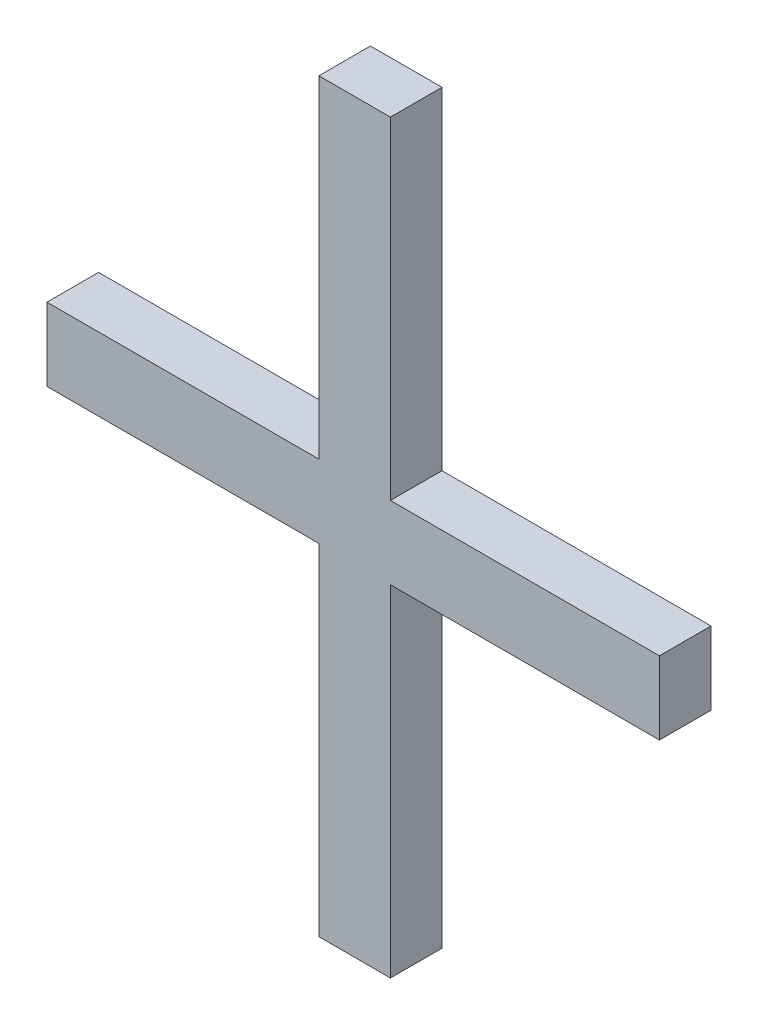
ISO-10303-21;
HEADER;
FILE_DESCRIPTION(('STEP AP214'),'2;1');
FILE_NAME('part.step','',(''),(''),'','','');
FILE_SCHEMA(('AUTOMOTIVE_DESIGN { 1 0 10303 214 1 1 1 1 }'));
ENDSEC;
DATA;
#1=APPLICATION_CONTEXT('core data for automotive mechanical design processes');
#2=APPLICATION_PROTOCOL_DEFINITION('international standard','automotive_design',2000,#1);
#3=PRODUCT_CONTEXT('',#1,'mechanical');
#4=PRODUCT('Part','Part','',(#3));
#5=PRODUCT_RELATED_PRODUCT_CATEGORY('part','',(#4));
#6=PRODUCT_DEFINITION_FORMATION('','',#4);
#7=PRODUCT_DEFINITION_CONTEXT('part definition',#1,'design');
#8=PRODUCT_DEFINITION('design','',#6,#7);
#9=PRODUCT_DEFINITION_SHAPE('','',#8);
#10=(LENGTH_UNIT() NAMED_UNIT(*) SI_UNIT(.MILLI.,.METRE.));
#11=(NAMED_UNIT(*) PLANE_ANGLE_UNIT() SI_UNIT($,.RADIAN.));
#12=(NAMED_UNIT(*) SI_UNIT($,.STERADIAN.) SOLID_ANGLE_UNIT());
#13=UNCERTAINTY_MEASURE_WITH_UNIT(LENGTH_MEASURE(1.E-05),#10,'distance_accuracy_value','');
#14=(GEOMETRIC_REPRESENTATION_CONTEXT(3) GLOBAL_UNCERTAINTY_ASSIGNED_CONTEXT((#13)) GLOBAL_UNIT_ASSIGNED_CONTEXT((#10,
#11,#12)) REPRESENTATION_CONTEXT('',''));
#15=CARTESIAN_POINT('',(0.,0.,0.));
#16=DIRECTION('',(0.,0.,1.));
#17=DIRECTION('',(1.,0.,0.));
#18=AXIS2_PLACEMENT_3D('',#15,#16,#17);
#19=CARTESIAN_POINT('',(149.53068351896,58.9393713969111,-39.));
#20=DIRECTION('',(0.,0.,1.));
#21=DIRECTION('',(1.,0.,0.));
#22=AXIS2_PLACEMENT_3D('',#19,#20,#21);
#23=PLANE('',#22);
#24=DIRECTION('',(0.,1.,0.));
#25=VECTOR('',#24,1.);
#26=CARTESIAN_POINT('',(150.05772928872,59.7243922013511,-39.));
#27=LINE('',#26,#25);
#28=CARTESIAN_POINT('',(150.05772928872,59.7243922013511,-39.));
#29=VERTEX_POINT('',#28);
#30=CARTESIAN_POINT('',(150.05772928872,59.0808415772111,-39.));
#31=VERTEX_POINT('',#30);
#32=EDGE_CURVE('E159',#29,#31,#27,.F.);
#33=ORIENTED_EDGE('',*,*,#32,.T.);
#34=DIRECTION('',(1.,0.,0.));
#35=VECTOR('',#34,1.);
#36=CARTESIAN_POINT('',(150.05772928872,59.0808415772111,-39.));
#37=LINE('',#36,#35);
#38=CARTESIAN_POINT('',(149.53068351896,59.0808415772111,-39.));
#39=VERTEX_POINT('',#38);
#40=EDGE_CURVE('E164',#31,#39,#37,.F.);
#41=ORIENTED_EDGE('',*,*,#40,.T.);
#42=DIRECTION('',(0.,1.,0.));
#43=VECTOR('',#42,1.);
#44=CARTESIAN_POINT('',(149.53068351896,59.0808415772111,-39.));
#45=LINE('',#44,#43);
#46=CARTESIAN_POINT('',(149.53068351896,58.9393713969111,-39.));
#47=VERTEX_POINT('',#46);
#48=EDGE_CURVE('E106',#39,#47,#45,.F.);
#49=ORIENTED_EDGE('',*,*,#48,.T.);
#50=DIRECTION('',(1.,0.,0.));
#51=VECTOR('',#50,1.);
#52=CARTESIAN_POINT('',(149.53068351896,58.9393713969111,-39.));
#53=LINE('',#52,#51);
#54=CARTESIAN_POINT('',(150.05772928872,58.9393713969111,-39.));
#55=VERTEX_POINT('',#54);
#56=EDGE_CURVE('E20',#47,#55,#53,.T.);
#57=ORIENTED_EDGE('',*,*,#56,.T.);
#58=DIRECTION('',(0.,1.,0.));
#59=VECTOR('',#58,1.);
#60=CARTESIAN_POINT('',(150.05772928872,58.9393713969111,-39.));
#61=LINE('',#60,#59);
#62=CARTESIAN_POINT('',(150.05772928872,58.2791772221511,-39.));
#63=VERTEX_POINT('',#62);
#64=EDGE_CURVE('E103',#55,#63,#61,.F.);
#65=ORIENTED_EDGE('',*,*,#64,.T.);
#66=DIRECTION('',(1.,0.,0.));
#67=VECTOR('',#66,1.);
#68=CARTESIAN_POINT('',(150.05772928872,58.2791772221511,-39.));
#69=LINE('',#68,#67);
#70=CARTESIAN_POINT('',(150.19642554392,58.2791772221511,-39.));
#71=VERTEX_POINT('',#70);
#72=EDGE_CURVE('E124',#63,#71,#69,.T.);
#73=ORIENTED_EDGE('',*,*,#72,.T.);
#74=DIRECTION('',(0.,1.,0.));
#75=VECTOR('',#74,1.);
#76=CARTESIAN_POINT('',(150.19642554392,58.2791772221511,-39.));
#77=LINE('',#76,#75);
#78=CARTESIAN_POINT('',(150.19642554392,58.9393713969111,-39.));
#79=VERTEX_POINT('',#78);
#80=EDGE_CURVE('E129',#71,#79,#77,.T.);
#81=ORIENTED_EDGE('',*,*,#80,.T.);
#82=DIRECTION('',(1.,0.,0.));
#83=VECTOR('',#82,1.);
#84=CARTESIAN_POINT('',(150.19642554392,58.9393713969111,-39.));
#85=LINE('',#84,#83);
#86=CARTESIAN_POINT('',(150.71792346348,58.9393713969111,-39.));
#87=VERTEX_POINT('',#86);
#88=EDGE_CURVE('E134',#79,#87,#85,.T.);
#89=ORIENTED_EDGE('',*,*,#88,.T.);
#90=DIRECTION('',(0.,1.,0.));
#91=VECTOR('',#90,1.);
#92=CARTESIAN_POINT('',(150.71792346348,58.9393713969111,-39.));
#93=LINE('',#92,#91);
#94=CARTESIAN_POINT('',(150.71792346348,59.0808415772111,-39.));
#95=VERTEX_POINT('',#94);
#96=EDGE_CURVE('E139',#87,#95,#93,.T.);
#97=ORIENTED_EDGE('',*,*,#96,.T.);
#98=DIRECTION('',(1.,0.,0.));
#99=VECTOR('',#98,1.);
#100=CARTESIAN_POINT('',(150.71792346348,59.0808415772111,-39.));
#101=LINE('',#100,#99);
#102=CARTESIAN_POINT('',(150.19642554392,59.0808415772111,-39.));
#103=VERTEX_POINT('',#102);
#104=EDGE_CURVE('E144',#95,#103,#101,.F.);
#105=ORIENTED_EDGE('',*,*,#104,.T.);
#106=DIRECTION('',(0.,1.,0.));
#107=VECTOR('',#106,1.);
#108=CARTESIAN_POINT('',(150.19642554392,59.0808415772111,-39.));
#109=LINE('',#108,#107);
#110=CARTESIAN_POINT('',(150.19642554392,59.7243922013511,-39.));
#111=VERTEX_POINT('',#110);
#112=EDGE_CURVE('E149',#103,#111,#109,.T.);
#113=ORIENTED_EDGE('',*,*,#112,.T.);
#114=DIRECTION('',(1.,0.,0.));
#115=VECTOR('',#114,1.);
#116=CARTESIAN_POINT('',(150.19642554392,59.7243922013511,-39.));
#117=LINE('',#116,#115);
#118=EDGE_CURVE('E154',#111,#29,#117,.F.);
#119=ORIENTED_EDGE('',*,*,#118,.T.);
#120=EDGE_LOOP('',(#33,#41,#49,#57,#65,#73,#81,#89,#97,#105,#113,#119));
#121=FACE_BOUND('',#120,.T.);
#122=ADVANCED_FACE('F17',(#121),#23,.T.);
#123=CARTESIAN_POINT('',(149.53068351896,58.9393713969111,-39.));
#124=DIRECTION('',(0.,1.,0.));
#125=DIRECTION('',(0.,0.,1.));
#126=AXIS2_PLACEMENT_3D('',#123,#124,#125);
#127=PLANE('',#126);
#128=DIRECTION('',(0.,0.,-1.));
#129=VECTOR('',#128,1.);
#130=CARTESIAN_POINT('',(150.05772928872,58.9393713969111,-39.));
#131=LINE('',#130,#129);
#132=CARTESIAN_POINT('',(150.05772928872,58.9393713969111,-39.1));
#133=VERTEX_POINT('',#132);
#134=EDGE_CURVE('E111',#133,#55,#131,.F.);
#135=ORIENTED_EDGE('',*,*,#134,.T.);
#136=ORIENTED_EDGE('',*,*,#56,.F.);
#137=DIRECTION('',(0.,0.,-1.));
#138=VECTOR('',#137,1.);
#139=CARTESIAN_POINT('',(149.53068351896,58.9393713969111,-39.));
#140=LINE('',#139,#138);
#141=CARTESIAN_POINT('',(149.53068351896,58.9393713969111,-39.1));
#142=VERTEX_POINT('',#141);
#143=EDGE_CURVE('E168',#47,#142,#140,.T.);
#144=ORIENTED_EDGE('',*,*,#143,.T.);
#145=DIRECTION('',(1.,0.,0.));
#146=VECTOR('',#145,1.);
#147=CARTESIAN_POINT('',(149.53068351896,58.9393713969111,-39.1));
#148=LINE('',#147,#146);
#149=EDGE_CURVE('E121',#142,#133,#148,.T.);
#150=ORIENTED_EDGE('',*,*,#149,.T.);
#151=EDGE_LOOP('',(#135,#136,#144,#150));
#152=FACE_BOUND('',#151,.T.);
#153=ADVANCED_FACE('F120',(#152),#127,.F.);
#154=CARTESIAN_POINT('',(150.05772928872,58.9393713969111,-39.));
#155=DIRECTION('',(1.,0.,0.));
#156=DIRECTION('',(0.,0.,-1.));
#157=AXIS2_PLACEMENT_3D('',#154,#155,#156);
#158=PLANE('',#157);
#159=DIRECTION('',(0.,0.,1.));
#160=VECTOR('',#159,1.);
#161=CARTESIAN_POINT('',(150.05772928872,58.2791772221511,-39.));
#162=LINE('',#161,#160);
#163=CARTESIAN_POINT('',(150.05772928872,58.2791772221511,-39.1));
#164=VERTEX_POINT('',#163);
#165=EDGE_CURVE('E117',#164,#63,#162,.T.);
#166=ORIENTED_EDGE('',*,*,#165,.T.);
#167=ORIENTED_EDGE('',*,*,#64,.F.);
#168=ORIENTED_EDGE('',*,*,#134,.F.);
#169=DIRECTION('',(0.,1.,0.));
#170=VECTOR('',#169,1.);
#171=CARTESIAN_POINT('',(150.05772928872,58.9393713969111,-39.1));
#172=LINE('',#171,#170);
#173=EDGE_CURVE('E171',#133,#164,#172,.F.);
#174=ORIENTED_EDGE('',*,*,#173,.T.);
#175=EDGE_LOOP('',(#166,#167,#168,#174));
#176=FACE_BOUND('',#175,.T.);
#177=ADVANCED_FACE('F114',(#176),#158,.F.);
#178=CARTESIAN_POINT('',(150.05772928872,58.2791772221511,-39.));
#179=DIRECTION('',(0.,1.,0.));
#180=DIRECTION('',(0.,0.,1.));
#181=AXIS2_PLACEMENT_3D('',#178,#179,#180);
#182=PLANE('',#181);
#183=DIRECTION('',(0.,0.,1.));
#184=VECTOR('',#183,1.);
#185=CARTESIAN_POINT('',(150.19642554392,58.2791772221511,-39.));
#186=LINE('',#185,#184);
#187=CARTESIAN_POINT('',(150.19642554392,58.2791772221511,-39.1));
#188=VERTEX_POINT('',#187);
#189=EDGE_CURVE('E126',#188,#71,#186,.T.);
#190=ORIENTED_EDGE('',*,*,#189,.T.);
#191=ORIENTED_EDGE('',*,*,#72,.F.);
#192=ORIENTED_EDGE('',*,*,#165,.F.);
#193=DIRECTION('',(1.,0.,0.));
#194=VECTOR('',#193,1.);
#195=CARTESIAN_POINT('',(149.53068351896,58.2791772221511,-39.1));
#196=LINE('',#195,#194);
#197=EDGE_CURVE('E173',#164,#188,#196,.T.);
#198=ORIENTED_EDGE('',*,*,#197,.T.);
#199=EDGE_LOOP('',(#190,#191,#192,#198));
#200=FACE_BOUND('',#199,.T.);
#201=ADVANCED_FACE('F234',(#200),#182,.F.);
#202=CARTESIAN_POINT('',(150.19642554392,58.2791772221511,-39.));
#203=DIRECTION('',(-1.,0.,0.));
#204=DIRECTION('',(0.,0.,1.));
#205=AXIS2_PLACEMENT_3D('',#202,#203,#204);
#206=PLANE('',#205);
#207=DIRECTION('',(0.,0.,1.));
#208=VECTOR('',#207,1.);
#209=CARTESIAN_POINT('',(150.19642554392,58.9393713969111,-39.));
#210=LINE('',#209,#208);
#211=CARTESIAN_POINT('',(150.19642554392,58.9393713969111,-39.1));
#212=VERTEX_POINT('',#211);
#213=EDGE_CURVE('E131',#212,#79,#210,.T.);
#214=ORIENTED_EDGE('',*,*,#213,.T.);
#215=ORIENTED_EDGE('',*,*,#80,.F.);
#216=ORIENTED_EDGE('',*,*,#189,.F.);
#217=DIRECTION('',(0.,1.,0.));
#218=VECTOR('',#217,1.);
#219=CARTESIAN_POINT('',(150.19642554392,58.9393713969111,-39.1));
#220=LINE('',#219,#218);
#221=EDGE_CURVE('E176',#188,#212,#220,.T.);
#222=ORIENTED_EDGE('',*,*,#221,.T.);
#223=EDGE_LOOP('',(#214,#215,#216,#222));
#224=FACE_BOUND('',#223,.T.);
#225=ADVANCED_FACE('F231',(#224),#206,.F.);
#226=CARTESIAN_POINT('',(150.19642554392,58.9393713969111,-39.));
#227=DIRECTION('',(0.,1.,0.));
#228=DIRECTION('',(0.,0.,1.));
#229=AXIS2_PLACEMENT_3D('',#226,#227,#228);
#230=PLANE('',#229);
#231=DIRECTION('',(0.,0.,1.));
#232=VECTOR('',#231,1.);
#233=CARTESIAN_POINT('',(150.71792346348,58.9393713969111,-39.));
#234=LINE('',#233,#232);
#235=CARTESIAN_POINT('',(150.71792346348,58.9393713969111,-39.1));
#236=VERTEX_POINT('',#235);
#237=EDGE_CURVE('E136',#236,#87,#234,.T.);
#238=ORIENTED_EDGE('',*,*,#237,.T.);
#239=ORIENTED_EDGE('',*,*,#88,.F.);
#240=ORIENTED_EDGE('',*,*,#213,.F.);
#241=DIRECTION('',(1.,0.,0.));
#242=VECTOR('',#241,1.);
#243=CARTESIAN_POINT('',(149.53068351896,58.9393713969111,-39.1));
#244=LINE('',#243,#242);
#245=EDGE_CURVE('E179',#212,#236,#244,.T.);
#246=ORIENTED_EDGE('',*,*,#245,.T.);
#247=EDGE_LOOP('',(#238,#239,#240,#246));
#248=FACE_BOUND('',#247,.T.);
#249=ADVANCED_FACE('F227',(#248),#230,.F.);
#250=CARTESIAN_POINT('',(150.71792346348,58.9393713969111,-39.));
#251=DIRECTION('',(-1.,0.,0.));
#252=DIRECTION('',(0.,0.,1.));
#253=AXIS2_PLACEMENT_3D('',#250,#251,#252);
#254=PLANE('',#253);
#255=DIRECTION('',(0.,0.,-1.));
#256=VECTOR('',#255,1.);
#257=CARTESIAN_POINT('',(150.71792346348,59.0808415772111,-39.));
#258=LINE('',#257,#256);
#259=CARTESIAN_POINT('',(150.71792346348,59.0808415772111,-39.1));
#260=VERTEX_POINT('',#259);
#261=EDGE_CURVE('E141',#260,#95,#258,.F.);
#262=ORIENTED_EDGE('',*,*,#261,.T.);
#263=ORIENTED_EDGE('',*,*,#96,.F.);
#264=ORIENTED_EDGE('',*,*,#237,.F.);
#265=DIRECTION('',(0.,1.,0.));
#266=VECTOR('',#265,1.);
#267=CARTESIAN_POINT('',(150.71792346348,58.9393713969111,-39.1));
#268=LINE('',#267,#266);
#269=EDGE_CURVE('E182',#236,#260,#268,.T.);
#270=ORIENTED_EDGE('',*,*,#269,.T.);
#271=EDGE_LOOP('',(#262,#263,#264,#270));
#272=FACE_BOUND('',#271,.T.);
#273=ADVANCED_FACE('F223',(#272),#254,.F.);
#274=CARTESIAN_POINT('',(150.71792346348,59.0808415772111,-39.));
#275=DIRECTION('',(0.,-1.,0.));
#276=DIRECTION('',(0.,0.,-1.));
#277=AXIS2_PLACEMENT_3D('',#274,#275,#276);
#278=PLANE('',#277);
#279=DIRECTION('',(0.,0.,1.));
#280=VECTOR('',#279,1.);
#281=CARTESIAN_POINT('',(150.19642554392,59.0808415772111,-39.));
#282=LINE('',#281,#280);
#283=CARTESIAN_POINT('',(150.19642554392,59.0808415772111,-39.1));
#284=VERTEX_POINT('',#283);
#285=EDGE_CURVE('E146',#284,#103,#282,.T.);
#286=ORIENTED_EDGE('',*,*,#285,.T.);
#287=ORIENTED_EDGE('',*,*,#104,.F.);
#288=ORIENTED_EDGE('',*,*,#261,.F.);
#289=DIRECTION('',(1.,0.,0.));
#290=VECTOR('',#289,1.);
#291=CARTESIAN_POINT('',(149.53068351896,59.0808415772111,-39.1));
#292=LINE('',#291,#290);
#293=EDGE_CURVE('E185',#260,#284,#292,.F.);
#294=ORIENTED_EDGE('',*,*,#293,.T.);
#295=EDGE_LOOP('',(#286,#287,#288,#294));
#296=FACE_BOUND('',#295,.T.);
#297=ADVANCED_FACE('F219',(#296),#278,.F.);
#298=CARTESIAN_POINT('',(150.19642554392,59.0808415772111,-39.));
#299=DIRECTION('',(-1.,0.,0.));
#300=DIRECTION('',(0.,0.,1.));
#301=AXIS2_PLACEMENT_3D('',#298,#299,#300);
#302=PLANE('',#301);
#303=DIRECTION('',(0.,0.,-1.));
#304=VECTOR('',#303,1.);
#305=CARTESIAN_POINT('',(150.19642554392,59.7243922013511,-39.));
#306=LINE('',#305,#304);
#307=CARTESIAN_POINT('',(150.19642554392,59.7243922013511,-39.1));
#308=VERTEX_POINT('',#307);
#309=EDGE_CURVE('E151',#308,#111,#306,.F.);
#310=ORIENTED_EDGE('',*,*,#309,.T.);
#311=ORIENTED_EDGE('',*,*,#112,.F.);
#312=ORIENTED_EDGE('',*,*,#285,.F.);
#313=DIRECTION('',(0.,1.,0.));
#314=VECTOR('',#313,1.);
#315=CARTESIAN_POINT('',(150.19642554392,58.9393713969111,-39.1));
#316=LINE('',#315,#314);
#317=EDGE_CURVE('E188',#284,#308,#316,.T.);
#318=ORIENTED_EDGE('',*,*,#317,.T.);
#319=EDGE_LOOP('',(#310,#311,#312,#318));
#320=FACE_BOUND('',#319,.T.);
#321=ADVANCED_FACE('F215',(#320),#302,.F.);
#322=CARTESIAN_POINT('',(150.19642554392,59.7243922013511,-39.));
#323=DIRECTION('',(0.,-1.,0.));
#324=DIRECTION('',(0.,0.,-1.));
#325=AXIS2_PLACEMENT_3D('',#322,#323,#324);
#326=PLANE('',#325);
#327=DIRECTION('',(0.,0.,-1.));
#328=VECTOR('',#327,1.);
#329=CARTESIAN_POINT('',(150.05772928872,59.7243922013511,-39.));
#330=LINE('',#329,#328);
#331=CARTESIAN_POINT('',(150.05772928872,59.7243922013511,-39.1));
#332=VERTEX_POINT('',#331);
#333=EDGE_CURVE('E156',#332,#29,#330,.F.);
#334=ORIENTED_EDGE('',*,*,#333,.T.);
#335=ORIENTED_EDGE('',*,*,#118,.F.);
#336=ORIENTED_EDGE('',*,*,#309,.F.);
#337=DIRECTION('',(1.,0.,0.));
#338=VECTOR('',#337,1.);
#339=CARTESIAN_POINT('',(149.53068351896,59.7243922013511,-39.1));
#340=LINE('',#339,#338);
#341=EDGE_CURVE('E191',#308,#332,#340,.F.);
#342=ORIENTED_EDGE('',*,*,#341,.T.);
#343=EDGE_LOOP('',(#334,#335,#336,#342));
#344=FACE_BOUND('',#343,.T.);
#345=ADVANCED_FACE('F211',(#344),#326,.F.);
#346=CARTESIAN_POINT('',(150.05772928872,59.7243922013511,-39.));
#347=DIRECTION('',(1.,0.,0.));
#348=DIRECTION('',(0.,0.,-1.));
#349=AXIS2_PLACEMENT_3D('',#346,#347,#348);
#350=PLANE('',#349);
#351=DIRECTION('',(0.,0.,-1.));
#352=VECTOR('',#351,1.);
#353=CARTESIAN_POINT('',(150.05772928872,59.0808415772111,-39.));
#354=LINE('',#353,#352);
#355=CARTESIAN_POINT('',(150.05772928872,59.0808415772111,-39.1));
#356=VERTEX_POINT('',#355);
#357=EDGE_CURVE('E161',#356,#31,#354,.F.);
#358=ORIENTED_EDGE('',*,*,#357,.T.);
#359=ORIENTED_EDGE('',*,*,#32,.F.);
#360=ORIENTED_EDGE('',*,*,#333,.F.);
#361=DIRECTION('',(0.,1.,0.));
#362=VECTOR('',#361,1.);
#363=CARTESIAN_POINT('',(150.05772928872,58.9393713969111,-39.1));
#364=LINE('',#363,#362);
#365=EDGE_CURVE('E194',#332,#356,#364,.F.);
#366=ORIENTED_EDGE('',*,*,#365,.T.);
#367=EDGE_LOOP('',(#358,#359,#360,#366));
#368=FACE_BOUND('',#367,.T.);
#369=ADVANCED_FACE('F207',(#368),#350,.F.);
#370=CARTESIAN_POINT('',(150.05772928872,59.0808415772111,-39.));
#371=DIRECTION('',(0.,-1.,0.));
#372=DIRECTION('',(0.,0.,-1.));
#373=AXIS2_PLACEMENT_3D('',#370,#371,#372);
#374=PLANE('',#373);
#375=DIRECTION('',(0.,0.,-1.));
#376=VECTOR('',#375,1.);
#377=CARTESIAN_POINT('',(149.53068351896,59.0808415772111,-39.));
#378=LINE('',#377,#376);
#379=CARTESIAN_POINT('',(149.53068351896,59.0808415772111,-39.1));
#380=VERTEX_POINT('',#379);
#381=EDGE_CURVE('E34',#380,#39,#378,.F.);
#382=ORIENTED_EDGE('',*,*,#381,.T.);
#383=ORIENTED_EDGE('',*,*,#40,.F.);
#384=ORIENTED_EDGE('',*,*,#357,.F.);
#385=DIRECTION('',(1.,0.,0.));
#386=VECTOR('',#385,1.);
#387=CARTESIAN_POINT('',(149.53068351896,59.0808415772111,-39.1));
#388=LINE('',#387,#386);
#389=EDGE_CURVE('E26',#356,#380,#388,.F.);
#390=ORIENTED_EDGE('',*,*,#389,.T.);
#391=EDGE_LOOP('',(#382,#383,#384,#390));
#392=FACE_BOUND('',#391,.T.);
#393=ADVANCED_FACE('F200',(#392),#374,.F.);
#394=CARTESIAN_POINT('',(149.53068351896,59.0808415772111,-39.));
#395=DIRECTION('',(1.,0.,0.));
#396=DIRECTION('',(0.,0.,-1.));
#397=AXIS2_PLACEMENT_3D('',#394,#395,#396);
#398=PLANE('',#397);
#399=ORIENTED_EDGE('',*,*,#143,.F.);
#400=ORIENTED_EDGE('',*,*,#48,.F.);
#401=ORIENTED_EDGE('',*,*,#381,.F.);
#402=DIRECTION('',(0.,1.,0.));
#403=VECTOR('',#402,1.);
#404=CARTESIAN_POINT('',(149.53068351896,58.9393713969111,-39.1));
#405=LINE('',#404,#403);
#406=EDGE_CURVE('E11',#380,#142,#405,.F.);
#407=ORIENTED_EDGE('',*,*,#406,.T.);
#408=EDGE_LOOP('',(#399,#400,#401,#407));
#409=FACE_BOUND('',#408,.T.);
#410=ADVANCED_FACE('F235',(#409),#398,.F.);
#411=CARTESIAN_POINT('',(149.53068351896,58.9393713969111,-39.1));
#412=DIRECTION('',(0.,0.,1.));
#413=DIRECTION('',(1.,0.,0.));
#414=AXIS2_PLACEMENT_3D('',#411,#412,#413);
#415=PLANE('',#414);
#416=ORIENTED_EDGE('',*,*,#389,.F.);
#417=ORIENTED_EDGE('',*,*,#365,.F.);
#418=ORIENTED_EDGE('',*,*,#341,.F.);
#419=ORIENTED_EDGE('',*,*,#317,.F.);
#420=ORIENTED_EDGE('',*,*,#293,.F.);
#421=ORIENTED_EDGE('',*,*,#269,.F.);
#422=ORIENTED_EDGE('',*,*,#245,.F.);
#423=ORIENTED_EDGE('',*,*,#221,.F.);
#424=ORIENTED_EDGE('',*,*,#197,.F.);
#425=ORIENTED_EDGE('',*,*,#173,.F.);
#426=ORIENTED_EDGE('',*,*,#149,.F.);
#427=ORIENTED_EDGE('',*,*,#406,.F.);
#428=EDGE_LOOP('',(#416,#417,#418,#419,#420,#421,#422,#423,#424,#425,#426,#427));
#429=FACE_BOUND('',#428,.T.);
#430=ADVANCED_FACE('F204',(#429),#415,.F.);
#431=CLOSED_SHELL('',(#122,#153,#177,#201,#225,#249,#273,#297,#321,#345,#369,#393,#410,#430));
#432=MANIFOLD_SOLID_BREP('B1',#431);
#433=ADVANCED_BREP_SHAPE_REPRESENTATION('',(#18,#432),#14);
#434=SHAPE_DEFINITION_REPRESENTATION(#9,#433);
ENDSEC;
END-ISO-10303-21;
